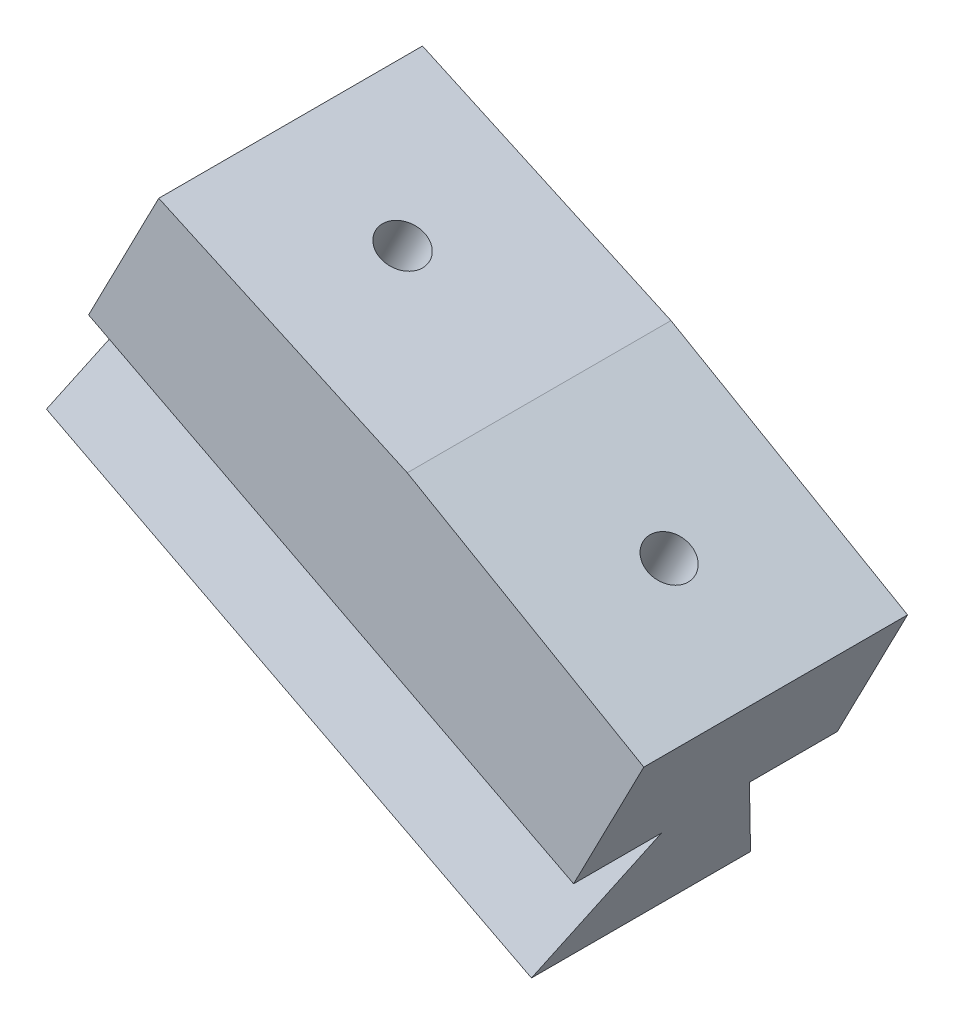
ISO-10303-21;
HEADER;
FILE_DESCRIPTION(('STEP AP214'),'2;1');
FILE_NAME('part.step','',(''),(''),'','','');
FILE_SCHEMA(('AUTOMOTIVE_DESIGN { 1 0 10303 214 1 1 1 1 }'));
ENDSEC;
DATA;
#1=APPLICATION_CONTEXT('core data for automotive mechanical design processes');
#2=APPLICATION_PROTOCOL_DEFINITION('international standard','automotive_design',2000,#1);
#3=PRODUCT_CONTEXT('',#1,'mechanical');
#4=PRODUCT('Part','Part','',(#3));
#5=PRODUCT_RELATED_PRODUCT_CATEGORY('part','',(#4));
#6=PRODUCT_DEFINITION_FORMATION('','',#4);
#7=PRODUCT_DEFINITION_CONTEXT('part definition',#1,'design');
#8=PRODUCT_DEFINITION('design','',#6,#7);
#9=PRODUCT_DEFINITION_SHAPE('','',#8);
#10=(LENGTH_UNIT() NAMED_UNIT(*) SI_UNIT(.MILLI.,.METRE.));
#11=(NAMED_UNIT(*) PLANE_ANGLE_UNIT() SI_UNIT($,.RADIAN.));
#12=(NAMED_UNIT(*) SI_UNIT($,.STERADIAN.) SOLID_ANGLE_UNIT());
#13=UNCERTAINTY_MEASURE_WITH_UNIT(LENGTH_MEASURE(1.E-05),#10,'distance_accuracy_value','');
#14=(GEOMETRIC_REPRESENTATION_CONTEXT(3) GLOBAL_UNCERTAINTY_ASSIGNED_CONTEXT((#13)) GLOBAL_UNIT_ASSIGNED_CONTEXT((#10,
#11,#12)) REPRESENTATION_CONTEXT('',''));
#15=CARTESIAN_POINT('',(0.,0.,0.));
#16=DIRECTION('',(0.,0.,1.));
#17=DIRECTION('',(1.,0.,0.));
#18=AXIS2_PLACEMENT_3D('',#15,#16,#17);
#19=CARTESIAN_POINT('',(-12.3261586807003,5.0782913770562,7.5));
#20=DIRECTION('',(-0.888762392801121,0.458368202586552,0.));
#21=DIRECTION('',(-0.458368202586552,-0.888762392801121,0.));
#22=AXIS2_PLACEMENT_3D('',#19,#20,#21);
#23=PLANE('',#22);
#24=DIRECTION('',(0.458368202586552,0.888762392801121,0.));
#25=VECTOR('',#24,1.);
#26=CARTESIAN_POINT('',(-12.3261586807003,5.0782913770562,7.5));
#27=LINE('',#26,#25);
#28=CARTESIAN_POINT('',(-16.320329204802,-2.66628717840336,7.5));
#29=VERTEX_POINT('',#28);
#30=CARTESIAN_POINT('',(-12.3261586807003,5.0782913770562,7.5));
#31=VERTEX_POINT('',#30);
#32=EDGE_CURVE('E153',#29,#31,#27,.T.);
#33=ORIENTED_EDGE('',*,*,#32,.F.);
#34=DIRECTION('',(0.,0.,1.));
#35=VECTOR('',#34,1.);
#36=CARTESIAN_POINT('',(-16.320329204802,-2.66628717840336,7.5));
#37=LINE('',#36,#35);
#38=CARTESIAN_POINT('',(-16.320329204802,-2.66628717840336,2.49999999999999));
#39=VERTEX_POINT('',#38);
#40=EDGE_CURVE('E116',#39,#29,#37,.T.);
#41=ORIENTED_EDGE('',*,*,#40,.F.);
#42=DIRECTION('',(0.415422671334184,0.80549227742098,-0.422618261740704));
#43=VECTOR('',#42,1.);
#44=CARTESIAN_POINT('',(-16.320329204802,-2.66628717840336,2.49999999999999));
#45=LINE('',#44,#43);
#46=CARTESIAN_POINT('',(-19.9872748254944,-9.77638632081233,6.23046126524003));
#47=VERTEX_POINT('',#46);
#48=EDGE_CURVE('E109',#47,#39,#45,.T.);
#49=ORIENTED_EDGE('',*,*,#48,.F.);
#50=DIRECTION('',(0.,0.,1.));
#51=VECTOR('',#50,1.);
#52=CARTESIAN_POINT('',(-19.9872748254946,-9.77638632081223,-48.0089916303859));
#53=LINE('',#52,#51);
#54=CARTESIAN_POINT('',(-19.9872748254946,-9.77638632081223,-6.23046126524006));
#55=VERTEX_POINT('',#54);
#56=EDGE_CURVE('E121',#55,#47,#53,.T.);
#57=ORIENTED_EDGE('',*,*,#56,.F.);
#58=DIRECTION('',(-0.415422671334184,-0.805492277420979,-0.422618261740704));
#59=VECTOR('',#58,1.);
#60=CARTESIAN_POINT('',(-19.9872748254944,-9.77638632081233,-6.23046126524005));
#61=LINE('',#60,#59);
#62=CARTESIAN_POINT('',(-16.320329204802,-2.66628717840336,-2.50000000000001));
#63=VERTEX_POINT('',#62);
#64=EDGE_CURVE('E52',#63,#55,#61,.T.);
#65=ORIENTED_EDGE('',*,*,#64,.F.);
#66=DIRECTION('',(0.,0.,1.));
#67=VECTOR('',#66,1.);
#68=CARTESIAN_POINT('',(-16.320329204802,-2.66628717840336,-2.50000000000001));
#69=LINE('',#68,#67);
#70=CARTESIAN_POINT('',(-16.320329204802,-2.66628717840336,-7.50000000000001));
#71=VERTEX_POINT('',#70);
#72=EDGE_CURVE('E178',#71,#63,#69,.T.);
#73=ORIENTED_EDGE('',*,*,#72,.F.);
#74=DIRECTION('',(0.458368202586552,0.888762392801121,0.));
#75=VECTOR('',#74,1.);
#76=CARTESIAN_POINT('',(-12.3261586807003,5.0782913770562,-7.5));
#77=LINE('',#76,#75);
#78=CARTESIAN_POINT('',(-12.3261586807003,5.0782913770562,-7.5));
#79=VERTEX_POINT('',#78);
#80=EDGE_CURVE('E152',#71,#79,#77,.T.);
#81=ORIENTED_EDGE('',*,*,#80,.T.);
#82=DIRECTION('',(0.,0.,-1.));
#83=VECTOR('',#82,1.);
#84=CARTESIAN_POINT('',(-12.3261586807003,5.0782913770562,7.5));
#85=LINE('',#84,#83);
#86=EDGE_CURVE('E11',#31,#79,#85,.T.);
#87=ORIENTED_EDGE('',*,*,#86,.F.);
#88=EDGE_LOOP('',(#33,#41,#49,#57,#65,#73,#81,#87));
#89=FACE_BOUND('',#88,.T.);
#90=ADVANCED_FACE('F38',(#89),#23,.F.);
#91=CARTESIAN_POINT('',(-25.7839240841938,12.848135855454,7.5));
#92=DIRECTION('',(-0.499999999999999,-0.866025403784439,0.));
#93=DIRECTION('',(0.866025403784439,-0.5,0.));
#94=AXIS2_PLACEMENT_3D('',#91,#92,#93);
#95=PLANE('',#94);
#96=CARTESIAN_POINT('',(-18.3883365071911,8.57829137705606,0.));
#97=DIRECTION('',(-0.499999999999999,-0.866025403784439,0.));
#98=DIRECTION('',(0.866025403784439,-0.5,0.));
#99=AXIS2_PLACEMENT_3D('',#96,#97,#98);
#100=ELLIPSE('',#99,1.25140794482858,1.25);
#101=CARTESIAN_POINT('',(-17.3045854364719,7.95258740464177,0.));
#102=VERTEX_POINT('',#101);
#103=EDGE_CURVE('E238',#102,#102,#100,.T.);
#104=ORIENTED_EDGE('',*,*,#103,.T.);
#105=EDGE_LOOP('',(#104));
#106=FACE_BOUND('',#105,.T.);
#107=DIRECTION('',(-0.866025403784439,0.499999999999999,0.));
#108=VECTOR('',#107,1.);
#109=CARTESIAN_POINT('',(-25.7839240841938,12.848135855454,-7.5));
#110=LINE('',#109,#108);
#111=CARTESIAN_POINT('',(-25.7839240841938,12.8481358554541,-7.5));
#112=VERTEX_POINT('',#111);
#113=EDGE_CURVE('E155',#79,#112,#110,.T.);
#114=ORIENTED_EDGE('',*,*,#113,.T.);
#115=DIRECTION('',(0.,0.,-1.));
#116=VECTOR('',#115,1.);
#117=CARTESIAN_POINT('',(-25.7839240841938,12.8481358554541,7.5));
#118=LINE('',#117,#116);
#119=CARTESIAN_POINT('',(-25.7839240841938,12.848135855454,7.5));
#120=VERTEX_POINT('',#119);
#121=EDGE_CURVE('E143',#120,#112,#118,.T.);
#122=ORIENTED_EDGE('',*,*,#121,.F.);
#123=DIRECTION('',(-0.866025403784439,0.499999999999999,0.));
#124=VECTOR('',#123,1.);
#125=CARTESIAN_POINT('',(-25.7839240841938,12.848135855454,7.5));
#126=LINE('',#125,#124);
#127=EDGE_CURVE('E45',#31,#120,#126,.T.);
#128=ORIENTED_EDGE('',*,*,#127,.F.);
#129=ORIENTED_EDGE('',*,*,#86,.T.);
#130=EDGE_LOOP('',(#114,#122,#128,#129));
#131=FACE_BOUND('',#130,.T.);
#132=ADVANCED_FACE('F160',(#106,#131),#95,.F.);
#133=CARTESIAN_POINT('',(0.,0.,7.5));
#134=DIRECTION('',(0.,0.,-1.));
#135=DIRECTION('',(-1.,0.,0.));
#136=AXIS2_PLACEMENT_3D('',#133,#134,#135);
#137=PLANE('',#136);
#138=DIRECTION('',(0.458250775620201,0.88882294448528,0.));
#139=VECTOR('',#138,1.);
#140=CARTESIAN_POINT('',(-39.9181169189876,19.3061948349634,7.5));
#141=LINE('',#140,#139);
#142=CARTESIAN_POINT('',(-43.910324459835,11.5629113530098,7.5));
#143=VERTEX_POINT('',#142);
#144=CARTESIAN_POINT('',(-39.9181169189876,19.3061948349634,7.5));
#145=VERTEX_POINT('',#144);
#146=EDGE_CURVE('E137',#143,#145,#141,.T.);
#147=ORIENTED_EDGE('',*,*,#146,.F.);
#148=DIRECTION('',(0.888762392801121,-0.458368202586552,0.));
#149=VECTOR('',#148,1.);
#150=CARTESIAN_POINT('',(-49.9617569805376,14.6838627682088,7.5));
#151=LINE('',#150,#149);
#152=EDGE_CURVE('E127',#143,#29,#151,.T.);
#153=ORIENTED_EDGE('',*,*,#152,.T.);
#154=ORIENTED_EDGE('',*,*,#32,.T.);
#155=ORIENTED_EDGE('',*,*,#127,.T.);
#156=DIRECTION('',(0.909554423778395,-0.415584829108513,0.));
#157=VECTOR('',#156,1.);
#158=CARTESIAN_POINT('',(-25.7839240841938,12.8481358554541,7.5));
#159=LINE('',#158,#157);
#160=EDGE_CURVE('E139',#145,#120,#159,.T.);
#161=ORIENTED_EDGE('',*,*,#160,.F.);
#162=EDGE_LOOP('',(#147,#153,#154,#155,#161));
#163=FACE_BOUND('',#162,.T.);
#164=ADVANCED_FACE('F175',(#163),#137,.F.);
#165=CARTESIAN_POINT('',(0.,0.,-7.5));
#166=DIRECTION('',(0.,0.,-1.));
#167=DIRECTION('',(-1.,0.,0.));
#168=AXIS2_PLACEMENT_3D('',#165,#166,#167);
#169=PLANE('',#168);
#170=DIRECTION('',(0.888762392801121,-0.458368202586552,0.));
#171=VECTOR('',#170,1.);
#172=CARTESIAN_POINT('',(-49.9617569805376,14.6838627682088,-7.50000000000001));
#173=LINE('',#172,#171);
#174=CARTESIAN_POINT('',(-43.910324459835,11.5629113530098,-7.50000000000001));
#175=VERTEX_POINT('',#174);
#176=EDGE_CURVE('E179',#175,#71,#173,.T.);
#177=ORIENTED_EDGE('',*,*,#176,.F.);
#178=DIRECTION('',(0.458250775620201,0.88882294448528,0.));
#179=VECTOR('',#178,1.);
#180=CARTESIAN_POINT('',(-39.9181169189876,19.3061948349634,-7.5));
#181=LINE('',#180,#179);
#182=CARTESIAN_POINT('',(-39.9181169189876,19.3061948349634,-7.5));
#183=VERTEX_POINT('',#182);
#184=EDGE_CURVE('E129',#175,#183,#181,.T.);
#185=ORIENTED_EDGE('',*,*,#184,.T.);
#186=DIRECTION('',(0.909554423778395,-0.415584829108513,0.));
#187=VECTOR('',#186,1.);
#188=CARTESIAN_POINT('',(-25.7839240841938,12.8481358554541,-7.5));
#189=LINE('',#188,#187);
#190=EDGE_CURVE('E140',#183,#112,#189,.T.);
#191=ORIENTED_EDGE('',*,*,#190,.T.);
#192=ORIENTED_EDGE('',*,*,#113,.F.);
#193=ORIENTED_EDGE('',*,*,#80,.F.);
#194=EDGE_LOOP('',(#177,#185,#191,#192,#193));
#195=FACE_BOUND('',#194,.T.);
#196=ADVANCED_FACE('F167',(#195),#169,.T.);
#197=CARTESIAN_POINT('',(-39.9181169189876,19.3061948349634,7.5));
#198=DIRECTION('',(0.888822944485281,-0.458250775620201,0.));
#199=DIRECTION('',(-0.458250775620201,-0.888822944485281,0.));
#200=AXIS2_PLACEMENT_3D('',#197,#198,#199);
#201=PLANE('',#200);
#202=DIRECTION('',(-0.415316247007583,-0.80554715713957,0.42261825871097));
#203=VECTOR('',#202,1.);
#204=CARTESIAN_POINT('',(-43.9099858539249,11.5635681128411,2.49965544078477));
#205=LINE('',#204,#203);
#206=CARTESIAN_POINT('',(-43.910324459835,11.5629113530098,2.49999999999999));
#207=VERTEX_POINT('',#206);
#208=CARTESIAN_POINT('',(-47.5763306967925,4.45232773506843,6.2304612652397));
#209=VERTEX_POINT('',#208);
#210=EDGE_CURVE('E60',#207,#209,#205,.T.);
#211=ORIENTED_EDGE('',*,*,#210,.F.);
#212=DIRECTION('',(0.,0.,-1.));
#213=VECTOR('',#212,1.);
#214=CARTESIAN_POINT('',(-43.910324459835,11.5629113530098,7.5));
#215=LINE('',#214,#213);
#216=EDGE_CURVE('E122',#143,#207,#215,.T.);
#217=ORIENTED_EDGE('',*,*,#216,.F.);
#218=ORIENTED_EDGE('',*,*,#146,.T.);
#219=DIRECTION('',(0.,0.,-1.));
#220=VECTOR('',#219,1.);
#221=CARTESIAN_POINT('',(-39.9181169189876,19.3061948349634,7.5));
#222=LINE('',#221,#220);
#223=EDGE_CURVE('E149',#145,#183,#222,.T.);
#224=ORIENTED_EDGE('',*,*,#223,.T.);
#225=ORIENTED_EDGE('',*,*,#184,.F.);
#226=DIRECTION('',(0.,0.,-1.));
#227=VECTOR('',#226,1.);
#228=CARTESIAN_POINT('',(-43.910324459835,11.5629113530098,-2.50000000000001));
#229=LINE('',#228,#227);
#230=CARTESIAN_POINT('',(-43.910324459835,11.5629113530098,-2.50000000000001));
#231=VERTEX_POINT('',#230);
#232=EDGE_CURVE('E134',#231,#175,#229,.T.);
#233=ORIENTED_EDGE('',*,*,#232,.F.);
#234=DIRECTION('',(0.415316247007583,0.80554715713957,0.422618258710971));
#235=VECTOR('',#234,1.);
#236=CARTESIAN_POINT('',(-47.5759920383197,4.45298459685012,-6.23011665253777));
#237=LINE('',#236,#235);
#238=CARTESIAN_POINT('',(-47.5763306967928,4.45232773506787,-6.23046126524005));
#239=VERTEX_POINT('',#238);
#240=EDGE_CURVE('E200',#239,#231,#237,.T.);
#241=ORIENTED_EDGE('',*,*,#240,.F.);
#242=DIRECTION('',(0.,0.,1.));
#243=VECTOR('',#242,1.);
#244=CARTESIAN_POINT('',(-47.5763306967925,4.45232773506843,-48.0089916303859));
#245=LINE('',#244,#243);
#246=EDGE_CURVE('E126',#239,#209,#245,.T.);
#247=ORIENTED_EDGE('',*,*,#246,.T.);
#248=EDGE_LOOP('',(#211,#217,#218,#224,#225,#233,#241,#247));
#249=FACE_BOUND('',#248,.T.);
#250=ADVANCED_FACE('F185',(#249),#201,.F.);
#251=CARTESIAN_POINT('',(-25.7839240841938,12.8481358554541,7.5));
#252=DIRECTION('',(-0.415584829108513,-0.909554423778395,0.));
#253=DIRECTION('',(-0.909554423778395,0.415584829108513,0.));
#254=AXIS2_PLACEMENT_3D('',#251,#252,#253);
#255=PLANE('',#254);
#256=CARTESIAN_POINT('',(-33.5512359525386,16.3971010312037,0.));
#257=DIRECTION('',(-0.415584829108513,-0.909554423778395,0.));
#258=DIRECTION('',(-0.909554423778395,0.415584829108513,0.));
#259=AXIS2_PLACEMENT_3D('',#256,#257,#258);
#260=ELLIPSE('',#259,1.25141580528839,1.25);
#261=CARTESIAN_POINT('',(-34.6894667342249,16.9171704547882,0.));
#262=VERTEX_POINT('',#261);
#263=EDGE_CURVE('E236',#262,#262,#260,.T.);
#264=ORIENTED_EDGE('',*,*,#263,.T.);
#265=EDGE_LOOP('',(#264));
#266=FACE_BOUND('',#265,.T.);
#267=ORIENTED_EDGE('',*,*,#190,.F.);
#268=ORIENTED_EDGE('',*,*,#223,.F.);
#269=ORIENTED_EDGE('',*,*,#160,.T.);
#270=ORIENTED_EDGE('',*,*,#121,.T.);
#271=EDGE_LOOP('',(#267,#268,#269,#270));
#272=FACE_BOUND('',#271,.T.);
#273=ADVANCED_FACE('F171',(#266,#272),#255,.F.);
#274=CARTESIAN_POINT('',(-19.9872748254946,-9.77638632081223,-48.0089916303859));
#275=DIRECTION('',(-0.45836820258657,-0.888762392801111,0.));
#276=DIRECTION('',(0.888762392801111,-0.45836820258657,0.));
#277=AXIS2_PLACEMENT_3D('',#274,#275,#276);
#278=PLANE('',#277);
#279=CARTESIAN_POINT('',(-41.363994889996,1.2483924417996,0.));
#280=DIRECTION('',(-0.458368202586571,-0.888762392801111,0.));
#281=DIRECTION('',(0.888762392801111,-0.458368202586571,0.));
#282=AXIS2_PLACEMENT_3D('',#279,#280,#281);
#283=CIRCLE('',#282,1.25);
#284=CARTESIAN_POINT('',(-40.2530418989946,0.675432188566385,0.));
#285=VERTEX_POINT('',#284);
#286=EDGE_CURVE('E198',#285,#285,#283,.T.);
#287=ORIENTED_EDGE('',*,*,#286,.F.);
#288=EDGE_LOOP('',(#287));
#289=FACE_BOUND('',#288,.T.);
#290=CARTESIAN_POINT('',(-26.2016120199694,-6.57141883662244,0.));
#291=DIRECTION('',(-0.458368202586571,-0.888762392801111,0.));
#292=DIRECTION('',(0.888762392801111,-0.458368202586571,0.));
#293=AXIS2_PLACEMENT_3D('',#290,#291,#292);
#294=CIRCLE('',#293,1.25);
#295=CARTESIAN_POINT('',(-25.0906590289681,-7.14437908985565,0.));
#296=VERTEX_POINT('',#295);
#297=EDGE_CURVE('E240',#296,#296,#294,.T.);
#298=ORIENTED_EDGE('',*,*,#297,.F.);
#299=EDGE_LOOP('',(#298));
#300=FACE_BOUND('',#299,.T.);
#301=DIRECTION('',(0.888762392801121,-0.458368202586552,0.));
#302=VECTOR('',#301,1.);
#303=CARTESIAN_POINT('',(-53.62870260123,7.5737636257998,6.23046126524003));
#304=LINE('',#303,#302);
#305=EDGE_CURVE('E106',#209,#47,#304,.T.);
#306=ORIENTED_EDGE('',*,*,#305,.F.);
#307=ORIENTED_EDGE('',*,*,#246,.F.);
#308=DIRECTION('',(0.888762392801121,-0.458368202586552,0.));
#309=VECTOR('',#308,1.);
#310=CARTESIAN_POINT('',(-53.62870260123,7.5737636257998,-6.23046126524005));
#311=LINE('',#310,#309);
#312=EDGE_CURVE('E125',#239,#55,#311,.T.);
#313=ORIENTED_EDGE('',*,*,#312,.T.);
#314=ORIENTED_EDGE('',*,*,#56,.T.);
#315=EDGE_LOOP('',(#306,#307,#313,#314));
#316=FACE_BOUND('',#315,.T.);
#317=ADVANCED_FACE('F124',(#289,#300,#316),#278,.T.);
#318=CARTESIAN_POINT('',(-53.62870260123,7.5737636257998,-6.23046126524005));
#319=DIRECTION('',(-0.19371477301434,-0.375607217546118,0.906307787036648));
#320=DIRECTION('',(0.,-0.923806632386595,-0.382859381442507));
#321=AXIS2_PLACEMENT_3D('',#318,#319,#320);
#322=PLANE('',#321);
#323=ORIENTED_EDGE('',*,*,#240,.T.);
#324=DIRECTION('',(0.888762392801121,-0.458368202586552,0.));
#325=VECTOR('',#324,1.);
#326=CARTESIAN_POINT('',(-49.9617569805376,14.6838627682088,-2.50000000000001));
#327=LINE('',#326,#325);
#328=EDGE_CURVE('E181',#231,#63,#327,.T.);
#329=ORIENTED_EDGE('',*,*,#328,.T.);
#330=ORIENTED_EDGE('',*,*,#64,.T.);
#331=ORIENTED_EDGE('',*,*,#312,.F.);
#332=EDGE_LOOP('',(#323,#329,#330,#331));
#333=FACE_BOUND('',#332,.T.);
#334=ADVANCED_FACE('F203',(#333),#322,.F.);
#335=CARTESIAN_POINT('',(-49.9617569805376,14.6838627682088,-2.50000000000001));
#336=DIRECTION('',(0.458368202586552,0.888762392801121,0.));
#337=DIRECTION('',(-0.888762392801121,0.458368202586552,0.));
#338=AXIS2_PLACEMENT_3D('',#335,#336,#337);
#339=PLANE('',#338);
#340=ORIENTED_EDGE('',*,*,#232,.T.);
#341=ORIENTED_EDGE('',*,*,#176,.T.);
#342=ORIENTED_EDGE('',*,*,#72,.T.);
#343=ORIENTED_EDGE('',*,*,#328,.F.);
#344=EDGE_LOOP('',(#340,#341,#342,#343));
#345=FACE_BOUND('',#344,.T.);
#346=ADVANCED_FACE('F202',(#345),#339,.F.);
#347=CARTESIAN_POINT('',(-49.9617569805376,14.6838627682088,7.5));
#348=DIRECTION('',(0.458368202586552,0.888762392801121,0.));
#349=DIRECTION('',(-0.888762392801121,0.458368202586552,0.));
#350=AXIS2_PLACEMENT_3D('',#347,#348,#349);
#351=PLANE('',#350);
#352=ORIENTED_EDGE('',*,*,#216,.T.);
#353=DIRECTION('',(0.888762392801121,-0.458368202586552,0.));
#354=VECTOR('',#353,1.);
#355=CARTESIAN_POINT('',(-49.9617569805376,14.6838627682088,2.49999999999999));
#356=LINE('',#355,#354);
#357=EDGE_CURVE('E115',#207,#39,#356,.T.);
#358=ORIENTED_EDGE('',*,*,#357,.T.);
#359=ORIENTED_EDGE('',*,*,#40,.T.);
#360=ORIENTED_EDGE('',*,*,#152,.F.);
#361=EDGE_LOOP('',(#352,#358,#359,#360));
#362=FACE_BOUND('',#361,.T.);
#363=ADVANCED_FACE('F210',(#362),#351,.F.);
#364=CARTESIAN_POINT('',(-49.9617569805376,14.6838627682088,2.49999999999999));
#365=DIRECTION('',(-0.193714773014339,-0.375607217546118,-0.906307787036648));
#366=DIRECTION('',(0.,0.923806632386595,-0.382859381442507));
#367=AXIS2_PLACEMENT_3D('',#364,#365,#366);
#368=PLANE('',#367);
#369=ORIENTED_EDGE('',*,*,#210,.T.);
#370=ORIENTED_EDGE('',*,*,#305,.T.);
#371=ORIENTED_EDGE('',*,*,#48,.T.);
#372=ORIENTED_EDGE('',*,*,#357,.F.);
#373=EDGE_LOOP('',(#369,#370,#371,#372));
#374=FACE_BOUND('',#373,.T.);
#375=ADVANCED_FACE('F108',(#374),#368,.F.);
#376=CARTESIAN_POINT('',(-26.1557751997108,-6.48254259734233,0.));
#377=DIRECTION('',(-0.458368202586571,-0.888762392801111,0.));
#378=DIRECTION('',(0.888762392801111,-0.458368202586571,0.));
#379=AXIS2_PLACEMENT_3D('',#376,#377,#378);
#380=CYLINDRICAL_SURFACE('',#379,1.25);
#381=ORIENTED_EDGE('',*,*,#297,.T.);
#382=EDGE_LOOP('',(#381));
#383=FACE_BOUND('',#382,.T.);
#384=ORIENTED_EDGE('',*,*,#103,.F.);
#385=EDGE_LOOP('',(#384));
#386=FACE_BOUND('',#385,.T.);
#387=ADVANCED_FACE('F247',(#383,#386),#380,.F.);
#388=CARTESIAN_POINT('',(-41.3181580697374,1.33726868107971,0.));
#389=DIRECTION('',(-0.458368202586571,-0.888762392801111,0.));
#390=DIRECTION('',(0.888762392801111,-0.458368202586571,0.));
#391=AXIS2_PLACEMENT_3D('',#388,#389,#390);
#392=CYLINDRICAL_SURFACE('',#391,1.25);
#393=ORIENTED_EDGE('',*,*,#286,.T.);
#394=EDGE_LOOP('',(#393));
#395=FACE_BOUND('',#394,.T.);
#396=ORIENTED_EDGE('',*,*,#263,.F.);
#397=EDGE_LOOP('',(#396));
#398=FACE_BOUND('',#397,.T.);
#399=ADVANCED_FACE('F250',(#395,#398),#392,.F.);
#400=CLOSED_SHELL('',(#90,#132,#164,#196,#250,#273,#317,#334,#346,#363,#375,#387,#399));
#401=MANIFOLD_SOLID_BREP('B2',#400);
#402=ADVANCED_BREP_SHAPE_REPRESENTATION('',(#18,#401),#14);
#403=SHAPE_DEFINITION_REPRESENTATION(#9,#402);
ENDSEC;
END-ISO-10303-21;
